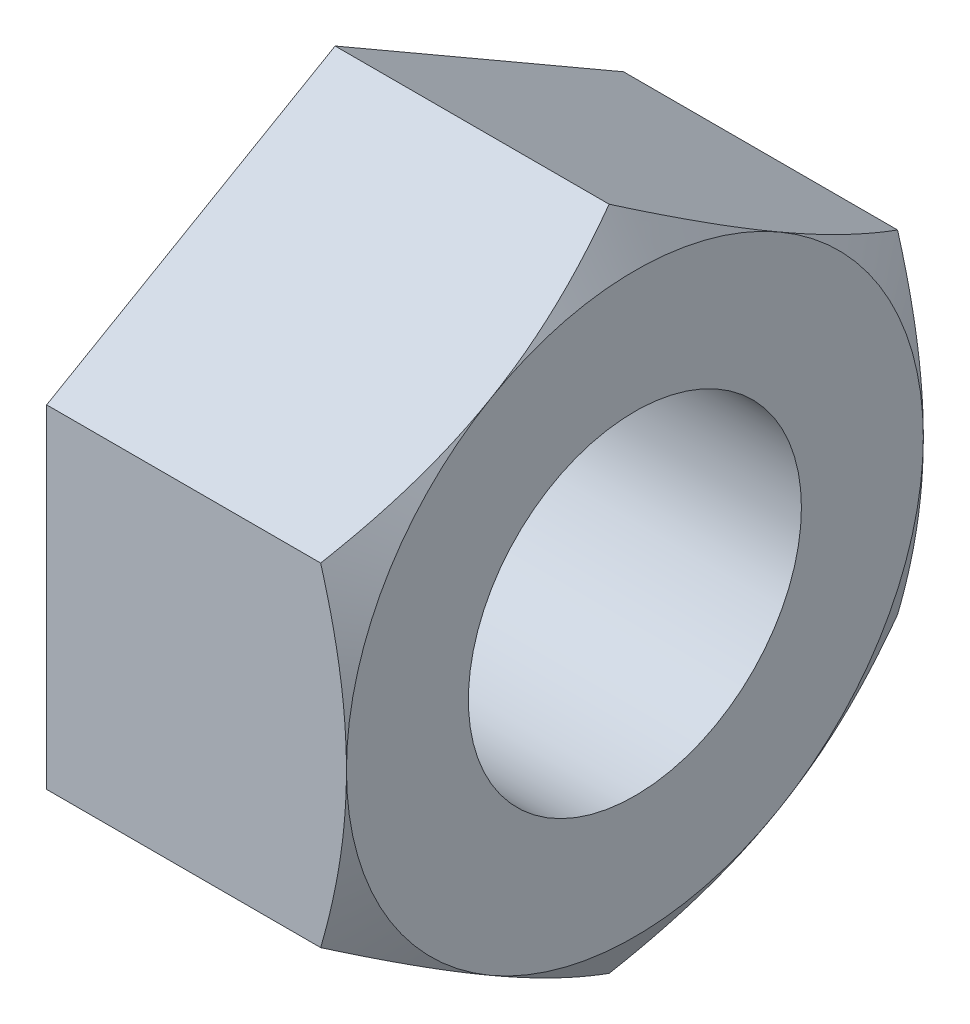
ISO-10303-21;
HEADER;
FILE_DESCRIPTION(('STEP AP214'),'2;1');
FILE_NAME('part.step','',(''),(''),'','','');
FILE_SCHEMA(('AUTOMOTIVE_DESIGN { 1 0 10303 214 1 1 1 1 }'));
ENDSEC;
DATA;
#1=APPLICATION_CONTEXT('core data for automotive mechanical design processes');
#2=APPLICATION_PROTOCOL_DEFINITION('international standard','automotive_design',2000,#1);
#3=PRODUCT_CONTEXT('',#1,'mechanical');
#4=PRODUCT('Part','Part','',(#3));
#5=PRODUCT_RELATED_PRODUCT_CATEGORY('part','',(#4));
#6=PRODUCT_DEFINITION_FORMATION('','',#4);
#7=PRODUCT_DEFINITION_CONTEXT('part definition',#1,'design');
#8=PRODUCT_DEFINITION('design','',#6,#7);
#9=PRODUCT_DEFINITION_SHAPE('','',#8);
#10=(LENGTH_UNIT() NAMED_UNIT(*) SI_UNIT(.MILLI.,.METRE.));
#11=(NAMED_UNIT(*) PLANE_ANGLE_UNIT() SI_UNIT($,.RADIAN.));
#12=(NAMED_UNIT(*) SI_UNIT($,.STERADIAN.) SOLID_ANGLE_UNIT());
#13=UNCERTAINTY_MEASURE_WITH_UNIT(LENGTH_MEASURE(1.E-05),#10,'distance_accuracy_value','');
#14=(GEOMETRIC_REPRESENTATION_CONTEXT(3) GLOBAL_UNCERTAINTY_ASSIGNED_CONTEXT((#13)) GLOBAL_UNIT_ASSIGNED_CONTEXT((#10,
#11,#12)) REPRESENTATION_CONTEXT('',''));
#15=CARTESIAN_POINT('',(0.,0.,0.));
#16=DIRECTION('',(0.,0.,1.));
#17=DIRECTION('',(1.,0.,0.));
#18=AXIS2_PLACEMENT_3D('',#15,#16,#17);
#19=CARTESIAN_POINT('',(-25.2,14.0000000000003,-24.2487113059641));
#20=DIRECTION('',(0.,0.866025403784441,-0.499999999999995));
#21=DIRECTION('',(0.,0.499999999999995,0.866025403784441));
#22=AXIS2_PLACEMENT_3D('',#19,#20,#21);
#23=PLANE('',#22);
#24=DIRECTION('',(1.,0.,0.));
#25=VECTOR('',#24,1.);
#26=CARTESIAN_POINT('',(-25.2,28.,0.));
#27=LINE('',#26,#25);
#28=CARTESIAN_POINT('',(-25.2,28.,0.));
#29=VERTEX_POINT('',#28);
#30=CARTESIAN_POINT('',(-2.16580753730943,28.,0.));
#31=VERTEX_POINT('',#30);
#32=EDGE_CURVE('E142',#29,#31,#27,.T.);
#33=ORIENTED_EDGE('',*,*,#32,.T.);
#34=CARTESIAN_POINT('',(-2.16587420438849,28.0001154700538,0.0002));
#35=CARTESIAN_POINT('',(-1.98822848779229,27.6924015716608,-0.53277610621168));
#36=CARTESIAN_POINT('',(-1.81864411876766,27.383487425241,-1.06783110298759));
#37=CARTESIAN_POINT('',(-1.4978388329674,26.7631820119119,-2.14223159508358));
#38=CARTESIAN_POINT('',(-1.34662395587958,26.4517899659592,-2.68157843974657));
#39=CARTESIAN_POINT('',(-1.06458731292961,25.8259203030604,-3.76561649480328));
#40=CARTESIAN_POINT('',(-0.933814246904632,25.5114371592268,-4.31031727804701));
#41=CARTESIAN_POINT('',(-0.695478379868691,24.8802990244591,-5.40348059405903));
#42=CARTESIAN_POINT('',(-0.587913266688639,24.5636442531268,-5.95194274646575));
#43=CARTESIAN_POINT('',(-0.400559284187938,23.9362568159745,-7.03860966364384));
#44=CARTESIAN_POINT('',(-0.320150834897783,23.6255706866053,-7.57673382491824));
#45=CARTESIAN_POINT('',(-0.185324249523843,23.0027748429148,-8.65544786893295));
#46=CARTESIAN_POINT('',(-0.130906613727792,22.6906651013076,-9.19603779893376));
#47=CARTESIAN_POINT('',(-0.0494356732256569,22.0659213356532,-10.2781257427592));
#48=CARTESIAN_POINT('',(-0.0223498519315814,21.7532883788812,-10.8196219080089));
#49=CARTESIAN_POINT('',(0.00387498579010867,21.1277339645803,-11.9031139364769));
#50=CARTESIAN_POINT('',(0.00301486580607339,20.8148125162653,-12.4451097837365));
#51=CARTESIAN_POINT('',(-0.0247002546745613,20.2298011084469,-13.4583792650854));
#52=CARTESIAN_POINT('',(-0.048175640758247,19.9576694832158,-13.929725066332));
#53=CARTESIAN_POINT('',(-0.11581620222437,19.4140559118843,-14.8712913915622));
#54=CARTESIAN_POINT('',(-0.159981081264717,19.1425739565345,-15.3415119315662));
#55=CARTESIAN_POINT('',(-0.268235206535844,18.6003600291061,-16.2806540024435));
#56=CARTESIAN_POINT('',(-0.332342469721303,18.3296289594629,-16.7495739702531));
#57=CARTESIAN_POINT('',(-0.479346775892425,17.7894631268708,-17.6851686368154));
#58=CARTESIAN_POINT('',(-0.562243739268895,17.5200283584346,-18.1518433450724));
#59=CARTESIAN_POINT('',(-0.841246600012504,16.702081799855,-19.5685683424084));
#60=CARTESIAN_POINT('',(-1.06518734914373,16.1558939383644,-20.5145934689875));
#61=CARTESIAN_POINT('',(-1.44643592846121,15.3426439625243,-21.9231837463969));
#62=CARTESIAN_POINT('',(-1.58093784030191,15.072798974828,-22.3905689752545));
#63=CARTESIAN_POINT('',(-1.86355831732602,14.5349754769091,-23.3221065991545));
#64=CARTESIAN_POINT('',(-2.01167304464737,14.266996463393,-23.7862598659266));
#65=CARTESIAN_POINT('',(-2.16587420438849,13.9998845299464,-24.2489113059641));
#66=B_SPLINE_CURVE_WITH_KNOTS('',3,(#34,#35,#36,#37,#38,#39,#40,#41,#42,#43,#44,#45,#46,#47,#48,
#49,#50,#51,#52,#53,#54,#55,#56,#57,#58,#59,#60,#61,#62,#63,#64,#65),.UNSPECIFIED.,.F.,.F.,(4,2,
2,2,2,2,2,2,2,2,2,2,2,2,2,4),(0.,1.92171215166388,3.84405444089411,5.77090885478267,
7.6975712106906,9.57671951619778,11.455903991291,13.3328501603323,15.2097383278453,
16.8436515929556,18.4775414557296,20.1129117651699,21.7482751459166,25.0910368365272,
26.7595060192956,28.4275062449903),.UNSPECIFIED.);
#67=CARTESIAN_POINT('',(0.,21.0000000000001,-12.1243556529821));
#68=VERTEX_POINT('',#67);
#69=EDGE_CURVE('E73',#31,#68,#66,.T.);
#70=ORIENTED_EDGE('',*,*,#69,.T.);
#71=CARTESIAN_POINT('',(-2.16580753730943,14.0000000000003,-24.2487113059641));
#72=VERTEX_POINT('',#71);
#73=EDGE_CURVE('E120',#68,#72,#66,.T.);
#74=ORIENTED_EDGE('',*,*,#73,.T.);
#75=DIRECTION('',(1.,0.,0.));
#76=VECTOR('',#75,1.);
#77=CARTESIAN_POINT('',(-25.2,14.0000000000003,-24.2487113059641));
#78=LINE('',#77,#76);
#79=CARTESIAN_POINT('',(-25.2,14.0000000000003,-24.2487113059641));
#80=VERTEX_POINT('',#79);
#81=EDGE_CURVE('E238',#80,#72,#78,.T.);
#82=ORIENTED_EDGE('',*,*,#81,.F.);
#83=DIRECTION('',(0.,0.499999999999995,0.866025403784441));
#84=VECTOR('',#83,1.);
#85=CARTESIAN_POINT('',(-25.2,14.0000000000003,-24.2487113059641));
#86=LINE('',#85,#84);
#87=EDGE_CURVE('E283',#80,#29,#86,.T.);
#88=ORIENTED_EDGE('',*,*,#87,.T.);
#89=EDGE_LOOP('',(#33,#70,#74,#82,#88));
#90=FACE_BOUND('',#89,.T.);
#91=ADVANCED_FACE('F48',(#90),#23,.T.);
#92=CARTESIAN_POINT('',(-25.2,-13.9999999999997,-24.2487113059644));
#93=DIRECTION('',(0.,0.,-1.));
#94=DIRECTION('',(0.,1.,0.));
#95=AXIS2_PLACEMENT_3D('',#92,#93,#94);
#96=PLANE('',#95);
#97=ORIENTED_EDGE('',*,*,#81,.T.);
#98=CARTESIAN_POINT('',(-18.2303426068557,50.2830483728458,-24.2487113059637));
#99=CARTESIAN_POINT('',(-17.9264745065844,49.6987243928906,-24.2487113059637));
#100=CARTESIAN_POINT('',(-17.6233883146198,49.1139938821121,-24.2487113059637));
#101=CARTESIAN_POINT('',(-17.0189410529942,47.9436399536802,-24.2487113059637));
#102=CARTESIAN_POINT('',(-16.7175799880843,47.3580165335733,-24.2487113059637));
#103=CARTESIAN_POINT('',(-15.8163038427311,45.5996429904596,-24.2487113059637));
#104=CARTESIAN_POINT('',(-15.219221231962,44.4254384014874,-24.2487113059638));
#105=CARTESIAN_POINT('',(-14.0333205937656,42.070576754026,-24.2487113059638));
#106=CARTESIAN_POINT('',(-13.4445168003427,40.8899125181816,-24.2487113059638));
#107=CARTESIAN_POINT('',(-12.2782639095432,38.5230052069772,-24.2487113059638));
#108=CARTESIAN_POINT('',(-11.7008146406476,37.3367622162246,-24.2487113059638));
#109=CARTESIAN_POINT('',(-10.5282434353,34.8911846059523,-24.2487113059639));
#110=CARTESIAN_POINT('',(-9.93392998935007,33.6314607704398,-24.2487113059639));
#111=CARTESIAN_POINT('',(-9.0575907845175,31.7348465684418,-24.2487113059639));
#112=CARTESIAN_POINT('',(-8.76799178917673,31.1014529147012,-24.2487113059639));
#113=CARTESIAN_POINT('',(-8.1945604785867,29.8320626517861,-24.2487113059639));
#114=CARTESIAN_POINT('',(-7.91072811990552,29.1960660622593,-24.2487113059639));
#115=CARTESIAN_POINT('',(-7.34978996037053,27.9215080616316,-24.2487113059639));
#116=CARTESIAN_POINT('',(-7.07268071188742,27.2829481695521,-24.2487113059639));
#117=CARTESIAN_POINT('',(-6.5260017827102,26.0026141889207,-24.248711305964));
#118=CARTESIAN_POINT('',(-6.25643200564468,25.3608401415768,-24.248711305964));
#119=CARTESIAN_POINT('',(-5.72597845780298,24.0737574547216,-24.248711305964));
#120=CARTESIAN_POINT('',(-5.46509409040655,23.4284490615534,-24.248711305964));
#121=CARTESIAN_POINT('',(-4.95333150562135,22.1338848979091,-24.248711305964));
#122=CARTESIAN_POINT('',(-4.70245308977375,21.4846292060186,-24.248711305964));
#123=CARTESIAN_POINT('',(-4.18176944150496,20.1007218374471,-24.248711305964));
#124=CARTESIAN_POINT('',(-3.91349153859368,19.3654933009253,-24.248711305964));
#125=CARTESIAN_POINT('',(-3.39417392415911,17.8889523571355,-24.248711305964));
#126=CARTESIAN_POINT('',(-3.14313417628384,17.1476399627008,-24.248711305964));
#127=CARTESIAN_POINT('',(-2.6613389512175,15.6582621022633,-24.2487113059641));
#128=CARTESIAN_POINT('',(-2.43058742103364,14.9101953533001,-24.2487113059641));
#129=CARTESIAN_POINT('',(-1.99299902159541,13.407058634502,-24.2487113059641));
#130=CARTESIAN_POINT('',(-1.78616212172445,12.6519886736345,-24.2487113059641));
#131=CARTESIAN_POINT('',(-1.40431392008632,11.1500612990514,-24.2487113059641));
#132=CARTESIAN_POINT('',(-1.22874310419316,10.4033470753554,-24.2487113059641));
#133=CARTESIAN_POINT('',(-0.908434937705082,8.90334868088959,-24.2487113059641));
#134=CARTESIAN_POINT('',(-0.763694877011462,8.15006509364734,-24.2487113059641));
#135=CARTESIAN_POINT('',(-0.50907203472112,6.63792490997426,-24.2487113059642));
#136=CARTESIAN_POINT('',(-0.399173465406968,5.87907099757432,-24.2487113059642));
#137=CARTESIAN_POINT('',(-0.217676121859996,4.35676022946965,-24.2487113059642));
#138=CARTESIAN_POINT('',(-0.146076778216185,3.59330344236851,-24.2487113059642));
#139=CARTESIAN_POINT('',(-0.0429284010364181,2.05117918113006,-24.2487113059642));
#140=CARTESIAN_POINT('',(-0.0120496323283682,1.27246625624166,-24.2487113059642));
#141=CARTESIAN_POINT('',(0.00625168842045326,-0.285473133073758,-24.2487113059642));
#142=CARTESIAN_POINT('',(-0.00632564265255237,-1.06469959611384,-24.2487113059642));
#143=CARTESIAN_POINT('',(-0.074434938256982,-2.62140196320291,-24.2487113059642));
#144=CARTESIAN_POINT('',(-0.129975247427174,-3.398877497747,-24.2487113059643));
#145=CARTESIAN_POINT('',(-0.281879497770434,-4.94980324845539,-24.2487113059643));
#146=CARTESIAN_POINT('',(-0.378244533016532,-5.72325335617881,-24.2487113059643));
#147=CARTESIAN_POINT('',(-0.610870293422916,-7.28084579576749,-24.2487113059643));
#148=CARTESIAN_POINT('',(-0.747933637576008,-8.064867096534,-24.2487113059643));
#149=CARTESIAN_POINT('',(-1.05679861907894,-9.62598349584658,-24.2487113059643));
#150=CARTESIAN_POINT('',(-1.22860083009572,-10.4030784797923,-24.2487113059643));
#151=CARTESIAN_POINT('',(-1.60248434456213,-11.9501637751449,-24.2487113059643));
#152=CARTESIAN_POINT('',(-1.80457561126259,-12.7201516599447,-24.2487113059643));
#153=CARTESIAN_POINT('',(-2.23467433480808,-14.2528090845579,-24.2487113059644));
#154=CARTESIAN_POINT('',(-2.46268186009403,-15.0154786050387,-24.2487113059644));
#155=CARTESIAN_POINT('',(-2.94627154860774,-16.5515093037593,-24.2487113059644));
#156=CARTESIAN_POINT('',(-3.20237172001878,-17.3247065732293,-24.2487113059644));
#157=CARTESIAN_POINT('',(-3.7340114232637,-18.8644161213763,-24.2487113059644));
#158=CARTESIAN_POINT('',(-4.009552261221,-19.6309279469962,-24.2487113059644));
#159=CARTESIAN_POINT('',(-4.57706144021518,-21.1580522611925,-24.2487113059644));
#160=CARTESIAN_POINT('',(-4.86903405215753,-21.9186631570149,-24.2487113059644));
#161=CARTESIAN_POINT('',(-5.46676948195774,-23.4344127896222,-24.2487113059645));
#162=CARTESIAN_POINT('',(-5.77253201213,-24.1895516401839,-24.2487113059645));
#163=CARTESIAN_POINT('',(-6.39614727291469,-25.696001247532,-24.2487113059645));
#164=CARTESIAN_POINT('',(-6.71401573788225,-26.4473054758546,-24.2487113059645));
#165=CARTESIAN_POINT('',(-7.35969325447421,-27.9456257295916,-24.2487113059645));
#166=CARTESIAN_POINT('',(-7.68750234768887,-28.6926417370491,-24.2487113059645));
#167=CARTESIAN_POINT('',(-8.35155360178582,-30.1827805270657,-24.2487113059645));
#168=CARTESIAN_POINT('',(-8.68779453124649,-30.9259038591843,-24.2487113059645));
#169=CARTESIAN_POINT('',(-9.3675547501432,-32.4088069421904,-24.2487113059646));
#170=CARTESIAN_POINT('',(-9.71107402377708,-33.1485867003329,-24.2487113059646));
#171=CARTESIAN_POINT('',(-10.7078671570518,-35.2716200488844,-24.2487113059646));
#172=CARTESIAN_POINT('',(-11.3690161082574,-36.6511769873956,-24.2487113059646));
#173=CARTESIAN_POINT('',(-12.7081825478356,-39.4021191908811,-24.2487113059646));
#174=CARTESIAN_POINT('',(-13.3862007276722,-40.773504118022,-24.2487113059646));
#175=CARTESIAN_POINT('',(-14.4117907962584,-42.8229432728247,-24.2487113059647));
#176=CARTESIAN_POINT('',(-14.7544000715297,-43.5034874989141,-24.2487113059647));
#177=CARTESIAN_POINT('',(-15.4425446508473,-44.8630962590798,-24.2487113059647));
#178=CARTESIAN_POINT('',(-15.7880799578433,-45.5421607916636,-24.2487113059647));
#179=CARTESIAN_POINT('',(-16.4817253032553,-46.8988922038909,-24.2487113059647));
#180=CARTESIAN_POINT('',(-16.8298350965783,-47.5765592089208,-24.2487113059647));
#181=CARTESIAN_POINT('',(-17.5283972322836,-48.9306810248819,-24.2487113059647));
#182=CARTESIAN_POINT('',(-17.8788495639677,-49.6071358413312,-24.2487113059647));
#183=CARTESIAN_POINT('',(-18.2303426068557,-50.2830483728453,-24.2487113059647));
#184=B_SPLINE_CURVE_WITH_KNOTS('',3,(#98,#99,#100,#101,#102,#103,#104,#105,#106,#107,#108,#109,
#110,#111,#112,#113,#114,#115,#116,#117,#118,#119,#120,#121,#122,#123,#124,#125,#126,#127,#128,
#129,#130,#131,#132,#133,#134,#135,#136,#137,#138,#139,#140,#141,#142,#143,#144,#145,#146,#147,
#148,#149,#150,#151,#152,#153,#154,#155,#156,#157,#158,#159,#160,#161,#162,#163,#164,#165,#166,
#167,#168,#169,#170,#171,#172,#173,#174,#175,#176,#177,#178,#179,#180,#181,#182,#183),
.UNSPECIFIED.,.F.,.F.,(4,2,2,2,2,2,2,2,2,2,2,2,2,2,2,2,2,2,2,2,2,2,2,2,2,2,2,2,2,2,2,2,2,2,2,2,
2,2,2,2,2,2,4),(0.,1.9758362561437,3.95167795130731,7.90352645534567,11.8614961868176,
15.8194060840877,19.9978841393504,22.0872380625785,24.1765762438179,26.264819336735,
28.353035724993,30.4411083717679,32.529139582931,34.8768926695487,37.2246408050505,
39.5728446813608,41.9210455513619,44.2217091905884,46.5221705123278,48.8215879316788,
51.120971163656,53.4577487046618,55.7945199603156,58.1317451977576,60.4690330751024,
62.8558806368755,65.242767617533,67.6304414685264,70.0181216251518,72.4613364738751,
74.9047156268658,77.3487328165168,79.7926990425867,82.2399580793445,84.6872273565239,
87.1341412818893,89.5810498952545,94.1702893922292,98.7597173115204,101.045470476437,
103.33122594587,105.61676654125,107.902296705683),.UNSPECIFIED.);
#185=CARTESIAN_POINT('',(0.,2.49384223390369E-13,-24.2487113059644));
#186=VERTEX_POINT('',#185);
#187=EDGE_CURVE('E123',#72,#186,#184,.T.);
#188=ORIENTED_EDGE('',*,*,#187,.T.);
#189=CARTESIAN_POINT('',(-2.16580753730943,-13.9999999999997,-24.2487113059644));
#190=VERTEX_POINT('',#189);
#191=EDGE_CURVE('E156',#186,#190,#184,.T.);
#192=ORIENTED_EDGE('',*,*,#191,.T.);
#193=DIRECTION('',(1.,0.,0.));
#194=VECTOR('',#193,1.);
#195=CARTESIAN_POINT('',(-25.2,-13.9999999999997,-24.2487113059644));
#196=LINE('',#195,#194);
#197=CARTESIAN_POINT('',(-25.2,-13.9999999999997,-24.2487113059644));
#198=VERTEX_POINT('',#197);
#199=EDGE_CURVE('E244',#198,#190,#196,.T.);
#200=ORIENTED_EDGE('',*,*,#199,.F.);
#201=DIRECTION('',(0.,1.,0.));
#202=VECTOR('',#201,1.);
#203=CARTESIAN_POINT('',(-25.2,-13.9999999999997,-24.2487113059644));
#204=LINE('',#203,#202);
#205=EDGE_CURVE('E241',#198,#80,#204,.T.);
#206=ORIENTED_EDGE('',*,*,#205,.T.);
#207=EDGE_LOOP('',(#97,#188,#192,#200,#206));
#208=FACE_BOUND('',#207,.T.);
#209=ADVANCED_FACE('F209',(#208),#96,.T.);
#210=CARTESIAN_POINT('',(-25.2,-28.,-1.95522954975215E-13));
#211=DIRECTION('',(0.,-0.866025403784435,-0.500000000000007));
#212=DIRECTION('',(0.,0.500000000000007,-0.866025403784435));
#213=AXIS2_PLACEMENT_3D('',#210,#211,#212);
#214=PLANE('',#213);
#215=ORIENTED_EDGE('',*,*,#199,.T.);
#216=CARTESIAN_POINT('',(-2.16587420438849,-13.9998845299459,-24.2489113059644));
#217=CARTESIAN_POINT('',(-1.98822848779229,-14.3075984283389,-23.7159351997527));
#218=CARTESIAN_POINT('',(-1.81864411876765,-14.6165125747587,-23.1808802029768));
#219=CARTESIAN_POINT('',(-1.49783883296739,-15.2368179880878,-22.1064797108808));
#220=CARTESIAN_POINT('',(-1.34662395587956,-15.5482100340405,-21.5671328662178));
#221=CARTESIAN_POINT('',(-1.06458731292959,-16.1740796969393,-20.4830948111611));
#222=CARTESIAN_POINT('',(-0.933814246904612,-16.4885628407729,-19.9383940279174));
#223=CARTESIAN_POINT('',(-0.695478379868666,-17.1197009755407,-18.8452307119054));
#224=CARTESIAN_POINT('',(-0.58791326668861,-17.436355746873,-18.2967685594987));
#225=CARTESIAN_POINT('',(-0.400559284187903,-18.0637431840253,-17.2101016423206));
#226=CARTESIAN_POINT('',(-0.320150834897745,-18.3744293133945,-16.6719774810462));
#227=CARTESIAN_POINT('',(-0.1853242495238,-18.997225157085,-15.5932634370315));
#228=CARTESIAN_POINT('',(-0.130906613727748,-19.3093348986922,-15.0526735070307));
#229=CARTESIAN_POINT('',(-0.0494356732256077,-19.9340786643467,-13.9705855632053));
#230=CARTESIAN_POINT('',(-0.0223498519315288,-20.2467116211187,-13.4290893979556));
#231=CARTESIAN_POINT('',(0.00387498579016621,-20.8722660354196,-12.3455973694875));
#232=CARTESIAN_POINT('',(0.00301486580613238,-21.1851874837346,-11.8036015222279));
#233=CARTESIAN_POINT('',(-0.0247002546744988,-21.770198891553,-10.7903320408791));
#234=CARTESIAN_POINT('',(-0.0481756407581831,-22.0423305167841,-10.3189862396324));
#235=CARTESIAN_POINT('',(-0.115816202224305,-22.5859440881156,-9.37741991440227));
#236=CARTESIAN_POINT('',(-0.159981081264652,-22.8574260434655,-8.90719937439824));
#237=CARTESIAN_POINT('',(-0.26823520653578,-23.3996399708938,-7.96805730352087));
#238=CARTESIAN_POINT('',(-0.33234246972124,-23.6703710405371,-7.4991373357113));
#239=CARTESIAN_POINT('',(-0.479346775892364,-24.2105368731292,-6.563542669149));
#240=CARTESIAN_POINT('',(-0.562243739268836,-24.4799716415654,-6.09686796089199));
#241=CARTESIAN_POINT('',(-0.841246600012452,-25.297918200145,-4.68014296355597));
#242=CARTESIAN_POINT('',(-1.06518734914368,-25.8441060616356,-3.73411783697685));
#243=CARTESIAN_POINT('',(-1.44643592846118,-26.6573560374759,-2.32552755956746));
#244=CARTESIAN_POINT('',(-1.58093784030189,-26.9272010251721,-1.85814233070979));
#245=CARTESIAN_POINT('',(-1.86355831732601,-27.465024523091,-0.926604706809807));
#246=CARTESIAN_POINT('',(-2.01167304464736,-27.7330035366072,-0.4624514400377));
#247=CARTESIAN_POINT('',(-2.16587420438849,-28.0001154700538,0.000199999999803655));
#248=B_SPLINE_CURVE_WITH_KNOTS('',3,(#216,#217,#218,#219,#220,#221,#222,#223,#224,#225,#226,
#227,#228,#229,#230,#231,#232,#233,#234,#235,#236,#237,#238,#239,#240,#241,#242,#243,#244,#245,
#246,#247),.UNSPECIFIED.,.F.,.F.,(4,2,2,2,2,2,2,2,2,2,2,2,2,2,2,4),(0.,1.92171215166388,
3.84405444089411,5.77090885478267,7.69757121069059,9.57671951619778,11.455903991291,
13.3328501603323,15.2097383278453,16.8436515929556,18.4775414557297,20.1129117651701,
21.7482751459167,25.0910368365275,26.7595060192959,28.4275062449906),.UNSPECIFIED.);
#249=CARTESIAN_POINT('',(0.,-21.,-12.1243556529824));
#250=VERTEX_POINT('',#249);
#251=EDGE_CURVE('E203',#190,#250,#248,.T.);
#252=ORIENTED_EDGE('',*,*,#251,.T.);
#253=CARTESIAN_POINT('',(-2.16580753730943,-28.,-1.95498945679743E-13));
#254=VERTEX_POINT('',#253);
#255=EDGE_CURVE('E195',#250,#254,#248,.T.);
#256=ORIENTED_EDGE('',*,*,#255,.T.);
#257=DIRECTION('',(1.,0.,0.));
#258=VECTOR('',#257,1.);
#259=CARTESIAN_POINT('',(-25.2,-28.,-1.95522954975215E-13));
#260=LINE('',#259,#258);
#261=CARTESIAN_POINT('',(-25.2,-28.,-1.95522954975215E-13));
#262=VERTEX_POINT('',#261);
#263=EDGE_CURVE('E250',#262,#254,#260,.T.);
#264=ORIENTED_EDGE('',*,*,#263,.F.);
#265=DIRECTION('',(0.,0.500000000000007,-0.866025403784434));
#266=VECTOR('',#265,1.);
#267=CARTESIAN_POINT('',(-25.2,-28.,-1.95522954975215E-13));
#268=LINE('',#267,#266);
#269=EDGE_CURVE('E266',#262,#198,#268,.T.);
#270=ORIENTED_EDGE('',*,*,#269,.T.);
#271=EDGE_LOOP('',(#215,#252,#256,#264,#270));
#272=FACE_BOUND('',#271,.T.);
#273=ADVANCED_FACE('F205',(#272),#214,.T.);
#274=CARTESIAN_POINT('',(-25.2,-14.0000000000001,24.2487113059642));
#275=DIRECTION('',(0.,-0.866025403784442,0.499999999999995));
#276=DIRECTION('',(0.,-0.499999999999995,-0.866025403784442));
#277=AXIS2_PLACEMENT_3D('',#274,#275,#276);
#278=PLANE('',#277);
#279=ORIENTED_EDGE('',*,*,#263,.T.);
#280=CARTESIAN_POINT('',(-2.16587420438849,-28.0001154700538,-0.000200000000195523));
#281=CARTESIAN_POINT('',(-1.98822848779229,-27.6924015716608,0.532776106211481));
#282=CARTESIAN_POINT('',(-1.81864411876766,-27.383487425241,1.06783110298739));
#283=CARTESIAN_POINT('',(-1.49783883296739,-26.7631820119119,2.14223159508338));
#284=CARTESIAN_POINT('',(-1.34662395587956,-26.4517899659592,2.68157843974637));
#285=CARTESIAN_POINT('',(-1.06458731292959,-25.8259203030604,3.76561649480308));
#286=CARTESIAN_POINT('',(-0.933814246904612,-25.5114371592268,4.31031727804681));
#287=CARTESIAN_POINT('',(-0.695478379868667,-24.8802990244591,5.40348059405883));
#288=CARTESIAN_POINT('',(-0.587913266688613,-24.5636442531268,5.95194274646554));
#289=CARTESIAN_POINT('',(-0.400559284187906,-23.9362568159745,7.03860966364364));
#290=CARTESIAN_POINT('',(-0.320150834897748,-23.6255706866053,7.57673382491804));
#291=CARTESIAN_POINT('',(-0.185324249523802,-23.0027748429148,8.65544786893275));
#292=CARTESIAN_POINT('',(-0.130906613727748,-22.6906651013076,9.19603779893355));
#293=CARTESIAN_POINT('',(-0.049435673225608,-22.0659213356532,10.278125742759));
#294=CARTESIAN_POINT('',(-0.0223498519315293,-21.7532883788812,10.8196219080087));
#295=CARTESIAN_POINT('',(0.00387498579016576,-21.1277339645803,11.9031139364767));
#296=CARTESIAN_POINT('',(0.00301486580613216,-20.8148125162653,12.4451097837363));
#297=CARTESIAN_POINT('',(-0.0247002546744985,-20.2298011084469,13.4583792650852));
#298=CARTESIAN_POINT('',(-0.0481756407581826,-19.9576694832158,13.9297250663318));
#299=CARTESIAN_POINT('',(-0.115816202224304,-19.4140559118843,14.871291391562));
#300=CARTESIAN_POINT('',(-0.15998108126465,-19.1425739565344,15.3415119315661));
#301=CARTESIAN_POINT('',(-0.268235206535779,-18.6003600291061,16.2806540024434));
#302=CARTESIAN_POINT('',(-0.33234246972124,-18.3296289594628,16.749573970253));
#303=CARTESIAN_POINT('',(-0.479346775892367,-17.7894631268707,17.6851686368153));
#304=CARTESIAN_POINT('',(-0.562243739268839,-17.5200283584345,18.1518433450723));
#305=CARTESIAN_POINT('',(-0.841246600012456,-16.7020817998549,19.5685683424084));
#306=CARTESIAN_POINT('',(-1.06518734914369,-16.1558939383643,20.5145934689875));
#307=CARTESIAN_POINT('',(-1.44643592846119,-15.3426439625241,21.9231837463969));
#308=CARTESIAN_POINT('',(-1.58093784030189,-15.0727989748279,22.3905689752546));
#309=CARTESIAN_POINT('',(-1.86355831732601,-14.534975476909,23.3221065991546));
#310=CARTESIAN_POINT('',(-2.01167304464736,-14.2669964633929,23.7862598659267));
#311=CARTESIAN_POINT('',(-2.16587420438849,-13.9998845299462,24.2489113059642));
#312=B_SPLINE_CURVE_WITH_KNOTS('',3,(#280,#281,#282,#283,#284,#285,#286,#287,#288,#289,#290,
#291,#292,#293,#294,#295,#296,#297,#298,#299,#300,#301,#302,#303,#304,#305,#306,#307,#308,#309,
#310,#311),.UNSPECIFIED.,.F.,.F.,(4,2,2,2,2,2,2,2,2,2,2,2,2,2,2,4),(0.,1.92171215166389,
3.84405444089411,5.77090885478267,7.69757121069059,9.57671951619779,11.455903991291,
13.3328501603323,15.2097383278453,16.8436515929556,18.4775414557297,20.1129117651701,
21.7482751459167,25.0910368365275,26.7595060192959,28.4275062449906),.UNSPECIFIED.);
#313=CARTESIAN_POINT('',(0.,-21.0000000000001,12.1243556529821));
#314=VERTEX_POINT('',#313);
#315=EDGE_CURVE('E204',#254,#314,#312,.T.);
#316=ORIENTED_EDGE('',*,*,#315,.T.);
#317=CARTESIAN_POINT('',(-2.16580753730943,-14.0000000000001,24.2487113059642));
#318=VERTEX_POINT('',#317);
#319=EDGE_CURVE('E189',#314,#318,#312,.T.);
#320=ORIENTED_EDGE('',*,*,#319,.T.);
#321=DIRECTION('',(1.,0.,0.));
#322=VECTOR('',#321,1.);
#323=CARTESIAN_POINT('',(-25.2,-14.0000000000001,24.2487113059642));
#324=LINE('',#323,#322);
#325=CARTESIAN_POINT('',(-25.2,-14.0000000000001,24.2487113059642));
#326=VERTEX_POINT('',#325);
#327=EDGE_CURVE('E258',#326,#318,#324,.T.);
#328=ORIENTED_EDGE('',*,*,#327,.F.);
#329=DIRECTION('',(0.,-0.499999999999995,-0.866025403784442));
#330=VECTOR('',#329,1.);
#331=CARTESIAN_POINT('',(-25.2,-14.0000000000001,24.2487113059642));
#332=LINE('',#331,#330);
#333=EDGE_CURVE('E269',#326,#262,#332,.T.);
#334=ORIENTED_EDGE('',*,*,#333,.T.);
#335=EDGE_LOOP('',(#279,#316,#320,#328,#334));
#336=FACE_BOUND('',#335,.T.);
#337=ADVANCED_FACE('F208',(#336),#278,.T.);
#338=CARTESIAN_POINT('',(-25.2,13.9999999999999,24.2487113059643));
#339=DIRECTION('',(0.,0.,1.));
#340=DIRECTION('',(0.,-1.,0.));
#341=AXIS2_PLACEMENT_3D('',#338,#339,#340);
#342=PLANE('',#341);
#343=ORIENTED_EDGE('',*,*,#327,.T.);
#344=CARTESIAN_POINT('',(-18.2303426068557,-50.2830483728456,24.2487113059641));
#345=CARTESIAN_POINT('',(-17.9264745065844,-49.6987243928904,24.2487113059641));
#346=CARTESIAN_POINT('',(-17.6233883146198,-49.1139938821119,24.2487113059641));
#347=CARTESIAN_POINT('',(-17.0189410529942,-47.9436399536801,24.2487113059641));
#348=CARTESIAN_POINT('',(-16.7175799880843,-47.3580165335732,24.2487113059641));
#349=CARTESIAN_POINT('',(-15.8163038427311,-45.5996429904594,24.2487113059641));
#350=CARTESIAN_POINT('',(-15.219221231962,-44.4254384014872,24.2487113059641));
#351=CARTESIAN_POINT('',(-14.0333205937656,-42.0705767540258,24.2487113059641));
#352=CARTESIAN_POINT('',(-13.4445168003427,-40.8899125181814,24.2487113059641));
#353=CARTESIAN_POINT('',(-12.2782639095432,-38.523005206977,24.2487113059641));
#354=CARTESIAN_POINT('',(-11.7008146406476,-37.3367622162244,24.2487113059641));
#355=CARTESIAN_POINT('',(-10.5282434353,-34.8911846059521,24.2487113059641));
#356=CARTESIAN_POINT('',(-9.93392998935007,-33.6314607704396,24.2487113059641));
#357=CARTESIAN_POINT('',(-9.0575907845175,-31.7348465684416,24.2487113059641));
#358=CARTESIAN_POINT('',(-8.76799178917673,-31.101452914701,24.2487113059641));
#359=CARTESIAN_POINT('',(-8.1945604785867,-29.832062651786,24.2487113059641));
#360=CARTESIAN_POINT('',(-7.91072811990552,-29.1960660622592,24.2487113059641));
#361=CARTESIAN_POINT('',(-7.34978996037053,-27.9215080616314,24.2487113059641));
#362=CARTESIAN_POINT('',(-7.07268071188742,-27.2829481695519,24.2487113059641));
#363=CARTESIAN_POINT('',(-6.5260017827102,-26.0026141889205,24.2487113059641));
#364=CARTESIAN_POINT('',(-6.25643200564468,-25.3608401415766,24.2487113059641));
#365=CARTESIAN_POINT('',(-5.72597845780298,-24.0737574547215,24.2487113059641));
#366=CARTESIAN_POINT('',(-5.46509409040655,-23.4284490615532,24.2487113059642));
#367=CARTESIAN_POINT('',(-4.95333150562135,-22.1338848979089,24.2487113059642));
#368=CARTESIAN_POINT('',(-4.70245308977375,-21.4846292060185,24.2487113059642));
#369=CARTESIAN_POINT('',(-4.18176944150496,-20.100721837447,24.2487113059642));
#370=CARTESIAN_POINT('',(-3.91349153859368,-19.3654933009252,24.2487113059642));
#371=CARTESIAN_POINT('',(-3.39417392415911,-17.8889523571353,24.2487113059642));
#372=CARTESIAN_POINT('',(-3.14313417628384,-17.1476399627006,24.2487113059642));
#373=CARTESIAN_POINT('',(-2.6613389512175,-15.6582621022632,24.2487113059642));
#374=CARTESIAN_POINT('',(-2.43058742103364,-14.9101953532999,24.2487113059642));
#375=CARTESIAN_POINT('',(-1.99299902159541,-13.4070586345019,24.2487113059642));
#376=CARTESIAN_POINT('',(-1.78616212172445,-12.6519886736343,24.2487113059642));
#377=CARTESIAN_POINT('',(-1.40431392008632,-11.1500612990513,24.2487113059642));
#378=CARTESIAN_POINT('',(-1.22874310419316,-10.4033470753552,24.2487113059642));
#379=CARTESIAN_POINT('',(-0.90843493770508,-8.90334868088941,24.2487113059642));
#380=CARTESIAN_POINT('',(-0.763694877011461,-8.15006509364715,24.2487113059642));
#381=CARTESIAN_POINT('',(-0.50907203472112,-6.63792490997408,24.2487113059642));
#382=CARTESIAN_POINT('',(-0.399173465406968,-5.87907099757413,24.2487113059642));
#383=CARTESIAN_POINT('',(-0.217676121859997,-4.35676022946947,24.2487113059642));
#384=CARTESIAN_POINT('',(-0.146076778216187,-3.59330344236832,24.2487113059642));
#385=CARTESIAN_POINT('',(-0.0429284010364215,-2.05117918112987,24.2487113059642));
#386=CARTESIAN_POINT('',(-0.0120496323283709,-1.27246625624147,24.2487113059642));
#387=CARTESIAN_POINT('',(0.00625168842045208,0.28547313307394,24.2487113059642));
#388=CARTESIAN_POINT('',(-0.00632564265255264,1.06469959611402,24.2487113059642));
#389=CARTESIAN_POINT('',(-0.074434938256983,2.62140196320309,24.2487113059642));
#390=CARTESIAN_POINT('',(-0.129975247427177,3.39887749774718,24.2487113059642));
#391=CARTESIAN_POINT('',(-0.281879497770438,4.94980324845558,24.2487113059642));
#392=CARTESIAN_POINT('',(-0.378244533016536,5.723253356179,24.2487113059642));
#393=CARTESIAN_POINT('',(-0.610870293422921,7.28084579576768,24.2487113059642));
#394=CARTESIAN_POINT('',(-0.747933637576013,8.06486709653419,24.2487113059642));
#395=CARTESIAN_POINT('',(-1.05679861907895,9.62598349584677,24.2487113059643));
#396=CARTESIAN_POINT('',(-1.22860083009572,10.4030784797925,24.2487113059643));
#397=CARTESIAN_POINT('',(-1.60248434456214,11.950163775145,24.2487113059643));
#398=CARTESIAN_POINT('',(-1.80457561126259,12.7201516599449,24.2487113059643));
#399=CARTESIAN_POINT('',(-2.23467433480809,14.252809084558,24.2487113059643));
#400=CARTESIAN_POINT('',(-2.46268186009404,15.0154786050389,24.2487113059643));
#401=CARTESIAN_POINT('',(-2.94627154860774,16.5515093037595,24.2487113059643));
#402=CARTESIAN_POINT('',(-3.20237172001879,17.3247065732295,24.2487113059643));
#403=CARTESIAN_POINT('',(-3.73401142326371,18.8644161213764,24.2487113059643));
#404=CARTESIAN_POINT('',(-4.00955226122101,19.6309279469964,24.2487113059643));
#405=CARTESIAN_POINT('',(-4.57706144021519,21.1580522611927,24.2487113059643));
#406=CARTESIAN_POINT('',(-4.86903405215754,21.9186631570151,24.2487113059643));
#407=CARTESIAN_POINT('',(-5.46676948195775,23.4344127896224,24.2487113059643));
#408=CARTESIAN_POINT('',(-5.77253201213,24.1895516401841,24.2487113059643));
#409=CARTESIAN_POINT('',(-6.3961472729147,25.6960012475322,24.2487113059643));
#410=CARTESIAN_POINT('',(-6.71401573788226,26.4473054758548,24.2487113059643));
#411=CARTESIAN_POINT('',(-7.35969325447422,27.9456257295918,24.2487113059643));
#412=CARTESIAN_POINT('',(-7.68750234768888,28.6926417370492,24.2487113059643));
#413=CARTESIAN_POINT('',(-8.35155360178583,30.1827805270659,24.2487113059643));
#414=CARTESIAN_POINT('',(-8.6877945312465,30.9259038591845,24.2487113059643));
#415=CARTESIAN_POINT('',(-9.36755475014321,32.4088069421906,24.2487113059643));
#416=CARTESIAN_POINT('',(-9.71107402377709,33.1485867003331,24.2487113059643));
#417=CARTESIAN_POINT('',(-10.7078671570518,35.2716200488845,24.2487113059643));
#418=CARTESIAN_POINT('',(-11.3690161082574,36.6511769873958,24.2487113059643));
#419=CARTESIAN_POINT('',(-12.7081825478356,39.4021191908813,24.2487113059644));
#420=CARTESIAN_POINT('',(-13.3862007276722,40.7735041180222,24.2487113059644));
#421=CARTESIAN_POINT('',(-14.4117907962584,42.8229432728248,24.2487113059644));
#422=CARTESIAN_POINT('',(-14.7544000715297,43.5034874989143,24.2487113059644));
#423=CARTESIAN_POINT('',(-15.4425446508473,44.86309625908,24.2487113059644));
#424=CARTESIAN_POINT('',(-15.7880799578433,45.5421607916637,24.2487113059644));
#425=CARTESIAN_POINT('',(-16.4817253032553,46.898892203891,24.2487113059644));
#426=CARTESIAN_POINT('',(-16.8298350965783,47.576559208921,24.2487113059644));
#427=CARTESIAN_POINT('',(-17.5283972322837,48.930681024882,24.2487113059644));
#428=CARTESIAN_POINT('',(-17.8788495639677,49.6071358413313,24.2487113059644));
#429=CARTESIAN_POINT('',(-18.2303426068557,50.2830483728454,24.2487113059644));
#430=B_SPLINE_CURVE_WITH_KNOTS('',3,(#344,#345,#346,#347,#348,#349,#350,#351,#352,#353,#354,
#355,#356,#357,#358,#359,#360,#361,#362,#363,#364,#365,#366,#367,#368,#369,#370,#371,#372,#373,
#374,#375,#376,#377,#378,#379,#380,#381,#382,#383,#384,#385,#386,#387,#388,#389,#390,#391,#392,
#393,#394,#395,#396,#397,#398,#399,#400,#401,#402,#403,#404,#405,#406,#407,#408,#409,#410,#411,
#412,#413,#414,#415,#416,#417,#418,#419,#420,#421,#422,#423,#424,#425,#426,#427,#428,#429),
.UNSPECIFIED.,.F.,.F.,(4,2,2,2,2,2,2,2,2,2,2,2,2,2,2,2,2,2,2,2,2,2,2,2,2,2,2,2,2,2,2,2,2,2,2,2,
2,2,2,2,2,2,4),(0.,1.97583625614371,3.95167795130731,7.90352645534568,11.8614961868176,
15.8194060840877,19.9978841393504,22.0872380625785,24.1765762438179,26.264819336735,
28.353035724993,30.4411083717679,32.529139582931,34.8768926695487,37.2246408050505,
39.5728446813608,41.9210455513619,44.2217091905884,46.5221705123278,48.8215879316788,
51.120971163656,53.4577487046618,55.7945199603156,58.1317451977576,60.4690330751024,
62.8558806368755,65.2427676175331,67.6304414685264,70.0181216251518,72.4613364738751,
74.9047156268658,77.3487328165168,79.7926990425867,82.2399580793445,84.6872273565239,
87.1341412818894,89.5810498952545,94.1702893922292,98.7597173115204,101.045470476437,
103.33122594587,105.61676654125,107.902296705683),.UNSPECIFIED.);
#431=CARTESIAN_POINT('',(0.,0.,24.2487113059644));
#432=VERTEX_POINT('',#431);
#433=EDGE_CURVE('E457',#318,#432,#430,.T.);
#434=ORIENTED_EDGE('',*,*,#433,.T.);
#435=CARTESIAN_POINT('',(-2.16580753730943,13.9999999999999,24.2487113059643));
#436=VERTEX_POINT('',#435);
#437=EDGE_CURVE('E182',#432,#436,#430,.T.);
#438=ORIENTED_EDGE('',*,*,#437,.T.);
#439=DIRECTION('',(1.,0.,0.));
#440=VECTOR('',#439,1.);
#441=CARTESIAN_POINT('',(-25.2,13.9999999999999,24.2487113059643));
#442=LINE('',#441,#440);
#443=CARTESIAN_POINT('',(-25.2,13.9999999999999,24.2487113059643));
#444=VERTEX_POINT('',#443);
#445=EDGE_CURVE('E262',#444,#436,#442,.T.);
#446=ORIENTED_EDGE('',*,*,#445,.F.);
#447=DIRECTION('',(0.,-1.,0.));
#448=VECTOR('',#447,1.);
#449=CARTESIAN_POINT('',(-25.2,13.9999999999999,24.2487113059643));
#450=LINE('',#449,#448);
#451=EDGE_CURVE('E273',#444,#326,#450,.T.);
#452=ORIENTED_EDGE('',*,*,#451,.T.);
#453=EDGE_LOOP('',(#343,#434,#438,#446,#452));
#454=FACE_BOUND('',#453,.T.);
#455=ADVANCED_FACE('F215',(#454),#342,.T.);
#456=CARTESIAN_POINT('',(-25.2,28.,0.));
#457=DIRECTION('',(0.,0.866025403784438,0.500000000000001));
#458=DIRECTION('',(0.,-0.500000000000001,0.866025403784438));
#459=AXIS2_PLACEMENT_3D('',#456,#457,#458);
#460=PLANE('',#459);
#461=ORIENTED_EDGE('',*,*,#445,.T.);
#462=CARTESIAN_POINT('',(-2.16587420438849,13.9998845299461,24.2489113059643));
#463=CARTESIAN_POINT('',(-1.98822848779229,14.307598428339,23.7159351997526));
#464=CARTESIAN_POINT('',(-1.81864411876766,14.6165125747589,23.1808802029767));
#465=CARTESIAN_POINT('',(-1.49783883296739,15.2368179880879,22.1064797108807));
#466=CARTESIAN_POINT('',(-1.34662395587956,15.5482100340407,21.5671328662177));
#467=CARTESIAN_POINT('',(-1.06458731292959,16.1740796969395,20.483094811161));
#468=CARTESIAN_POINT('',(-0.933814246904613,16.4885628407731,19.9383940279173));
#469=CARTESIAN_POINT('',(-0.695478379868668,17.1197009755408,18.8452307119053));
#470=CARTESIAN_POINT('',(-0.587913266688613,17.4363557468732,18.2967685594986));
#471=CARTESIAN_POINT('',(-0.400559284187905,18.0637431840254,17.2101016423205));
#472=CARTESIAN_POINT('',(-0.320150834897746,18.3744293133946,16.6719774810461));
#473=CARTESIAN_POINT('',(-0.185324249523801,18.9972251570851,15.5932634370314));
#474=CARTESIAN_POINT('',(-0.13090661372775,19.3093348986923,15.0526735070306));
#475=CARTESIAN_POINT('',(-0.0494356732256106,19.9340786643467,13.9705855632051));
#476=CARTESIAN_POINT('',(-0.022349851931531,20.2467116211188,13.4290893979555));
#477=CARTESIAN_POINT('',(0.00387498579016549,20.8722660354196,12.3455973694874));
#478=CARTESIAN_POINT('',(0.00301486580613264,21.1851874837346,11.8036015222278));
#479=CARTESIAN_POINT('',(-0.0247002546744989,21.770198891553,10.7903320408789));
#480=CARTESIAN_POINT('',(-0.0481756407581843,22.0423305167842,10.3189862396323));
#481=CARTESIAN_POINT('',(-0.115816202224306,22.5859440881157,9.37741991440212));
#482=CARTESIAN_POINT('',(-0.159981081264651,22.8574260434655,8.90719937439808));
#483=CARTESIAN_POINT('',(-0.26823520653578,23.3996399708939,7.96805730352071));
#484=CARTESIAN_POINT('',(-0.332342469721242,23.6703710405371,7.49913733571114));
#485=CARTESIAN_POINT('',(-0.479346775892369,24.2105368731293,6.56354266914883));
#486=CARTESIAN_POINT('',(-0.56224373926884,24.4799716415654,6.09686796089182));
#487=CARTESIAN_POINT('',(-0.841246600012455,25.2979182001451,4.68014296355579));
#488=CARTESIAN_POINT('',(-1.06518734914369,25.8441060616357,3.73411783697667));
#489=CARTESIAN_POINT('',(-1.44643592846119,26.6573560374759,2.32552755956727));
#490=CARTESIAN_POINT('',(-1.58093784030189,26.9272010251721,1.8581423307096));
#491=CARTESIAN_POINT('',(-1.86355831732601,27.465024523091,0.926604706809614));
#492=CARTESIAN_POINT('',(-2.01167304464736,27.7330035366072,0.462451440037506));
#493=CARTESIAN_POINT('',(-2.16587420438849,28.0001154700538,-0.000199999999999627));
#494=B_SPLINE_CURVE_WITH_KNOTS('',3,(#462,#463,#464,#465,#466,#467,#468,#469,#470,#471,#472,
#473,#474,#475,#476,#477,#478,#479,#480,#481,#482,#483,#484,#485,#486,#487,#488,#489,#490,#491,
#492,#493),.UNSPECIFIED.,.F.,.F.,(4,2,2,2,2,2,2,2,2,2,2,2,2,2,2,4),(0.,1.92171215166388,
3.84405444089411,5.77090885478267,7.6975712106906,9.57671951619779,11.455903991291,
13.3328501603323,15.2097383278453,16.8436515929556,18.4775414557297,20.1129117651701,
21.7482751459167,25.0910368365275,26.7595060192959,28.4275062449906),.UNSPECIFIED.);
#495=CARTESIAN_POINT('',(0.,21.0000000000001,12.1243556529822));
#496=VERTEX_POINT('',#495);
#497=EDGE_CURVE('E467',#436,#496,#494,.T.);
#498=ORIENTED_EDGE('',*,*,#497,.T.);
#499=EDGE_CURVE('E129',#496,#31,#494,.T.);
#500=ORIENTED_EDGE('',*,*,#499,.T.);
#501=ORIENTED_EDGE('',*,*,#32,.F.);
#502=DIRECTION('',(0.,-0.500000000000001,0.866025403784438));
#503=VECTOR('',#502,1.);
#504=CARTESIAN_POINT('',(-25.2,28.,0.));
#505=LINE('',#504,#503);
#506=EDGE_CURVE('E279',#29,#444,#505,.T.);
#507=ORIENTED_EDGE('',*,*,#506,.T.);
#508=EDGE_LOOP('',(#461,#498,#500,#501,#507));
#509=FACE_BOUND('',#508,.T.);
#510=ADVANCED_FACE('F219',(#509),#460,.T.);
#511=CARTESIAN_POINT('',(0.,0.,0.));
#512=DIRECTION('',(1.,0.,0.));
#513=DIRECTION('',(0.,0.,-1.));
#514=AXIS2_PLACEMENT_3D('',#511,#512,#513);
#515=PLANE('',#514);
#516=CARTESIAN_POINT('',(0.,0.,0.));
#517=DIRECTION('',(1.,0.,0.));
#518=DIRECTION('',(0.,0.,-1.));
#519=AXIS2_PLACEMENT_3D('',#516,#517,#518);
#520=CIRCLE('',#519,14.);
#521=CARTESIAN_POINT('',(0.,0.,-14.));
#522=VERTEX_POINT('',#521);
#523=EDGE_CURVE('E144',#522,#522,#520,.T.);
#524=ORIENTED_EDGE('',*,*,#523,.F.);
#525=EDGE_LOOP('',(#524));
#526=FACE_BOUND('',#525,.T.);
#527=CARTESIAN_POINT('',(0.,0.,0.));
#528=DIRECTION('',(1.,0.,0.));
#529=DIRECTION('',(0.,0.,-1.));
#530=AXIS2_PLACEMENT_3D('',#527,#528,#529);
#531=CIRCLE('',#530,24.2487113059644);
#532=EDGE_CURVE('E52',#250,#186,#531,.T.);
#533=ORIENTED_EDGE('',*,*,#532,.T.);
#534=CARTESIAN_POINT('',(0.,0.,0.));
#535=DIRECTION('',(1.,0.,0.));
#536=DIRECTION('',(0.,0.,-1.));
#537=AXIS2_PLACEMENT_3D('',#534,#535,#536);
#538=CIRCLE('',#537,24.2487113059644);
#539=EDGE_CURVE('E65',#186,#68,#538,.T.);
#540=ORIENTED_EDGE('',*,*,#539,.T.);
#541=EDGE_CURVE('E12',#68,#496,#531,.T.);
#542=ORIENTED_EDGE('',*,*,#541,.T.);
#543=EDGE_CURVE('E58',#496,#432,#531,.T.);
#544=ORIENTED_EDGE('',*,*,#543,.T.);
#545=EDGE_CURVE('E455',#432,#314,#531,.T.);
#546=ORIENTED_EDGE('',*,*,#545,.T.);
#547=EDGE_CURVE('E248',#314,#250,#531,.T.);
#548=ORIENTED_EDGE('',*,*,#547,.T.);
#549=EDGE_LOOP('',(#533,#540,#542,#544,#546,#548));
#550=FACE_BOUND('',#549,.T.);
#551=ADVANCED_FACE('F135',(#526,#550),#515,.T.);
#552=CARTESIAN_POINT('',(-25.2,0.,0.));
#553=DIRECTION('',(1.,0.,0.));
#554=DIRECTION('',(0.,0.,-1.));
#555=AXIS2_PLACEMENT_3D('',#552,#553,#554);
#556=PLANE('',#555);
#557=CARTESIAN_POINT('',(-25.2,0.,0.));
#558=DIRECTION('',(1.,0.,0.));
#559=DIRECTION('',(0.,0.,-1.));
#560=AXIS2_PLACEMENT_3D('',#557,#558,#559);
#561=CIRCLE('',#560,14.);
#562=CARTESIAN_POINT('',(-25.2,0.,-14.));
#563=VERTEX_POINT('',#562);
#564=EDGE_CURVE('E147',#563,#563,#561,.T.);
#565=ORIENTED_EDGE('',*,*,#564,.T.);
#566=EDGE_LOOP('',(#565));
#567=FACE_BOUND('',#566,.T.);
#568=ORIENTED_EDGE('',*,*,#87,.F.);
#569=ORIENTED_EDGE('',*,*,#205,.F.);
#570=ORIENTED_EDGE('',*,*,#269,.F.);
#571=ORIENTED_EDGE('',*,*,#333,.F.);
#572=ORIENTED_EDGE('',*,*,#451,.F.);
#573=ORIENTED_EDGE('',*,*,#506,.F.);
#574=EDGE_LOOP('',(#568,#569,#570,#571,#572,#573));
#575=FACE_BOUND('',#574,.T.);
#576=ADVANCED_FACE('F227',(#567,#575),#556,.F.);
#577=CARTESIAN_POINT('',(-25.2,0.,0.));
#578=DIRECTION('',(1.,0.,0.));
#579=DIRECTION('',(0.,0.,-1.));
#580=AXIS2_PLACEMENT_3D('',#577,#578,#579);
#581=CYLINDRICAL_SURFACE('',#580,14.);
#582=ORIENTED_EDGE('',*,*,#564,.F.);
#583=EDGE_LOOP('',(#582));
#584=FACE_BOUND('',#583,.T.);
#585=ORIENTED_EDGE('',*,*,#523,.T.);
#586=EDGE_LOOP('',(#585));
#587=FACE_BOUND('',#586,.T.);
#588=ADVANCED_FACE('F169',(#584,#587),#581,.F.);
#589=CARTESIAN_POINT('',(0.,0.,0.));
#590=DIRECTION('',(-1.,0.,0.));
#591=DIRECTION('',(0.,0.,-1.));
#592=AXIS2_PLACEMENT_3D('',#589,#590,#591);
#593=CONICAL_SURFACE('',#592,24.2487113059644,1.0471975511966);
#594=ORIENTED_EDGE('',*,*,#532,.F.);
#595=ORIENTED_EDGE('',*,*,#251,.F.);
#596=ORIENTED_EDGE('',*,*,#191,.F.);
#597=EDGE_LOOP('',(#594,#595,#596));
#598=FACE_BOUND('',#597,.T.);
#599=ADVANCED_FACE('F293',(#598),#593,.T.);
#600=ORIENTED_EDGE('',*,*,#547,.F.);
#601=ORIENTED_EDGE('',*,*,#315,.F.);
#602=ORIENTED_EDGE('',*,*,#255,.F.);
#603=EDGE_LOOP('',(#600,#601,#602));
#604=FACE_BOUND('',#603,.T.);
#605=ADVANCED_FACE('F299',(#604),#593,.T.);
#606=ORIENTED_EDGE('',*,*,#545,.F.);
#607=ORIENTED_EDGE('',*,*,#433,.F.);
#608=ORIENTED_EDGE('',*,*,#319,.F.);
#609=EDGE_LOOP('',(#606,#607,#608));
#610=FACE_BOUND('',#609,.T.);
#611=ADVANCED_FACE('F167',(#610),#593,.T.);
#612=ORIENTED_EDGE('',*,*,#543,.F.);
#613=ORIENTED_EDGE('',*,*,#497,.F.);
#614=ORIENTED_EDGE('',*,*,#437,.F.);
#615=EDGE_LOOP('',(#612,#613,#614));
#616=FACE_BOUND('',#615,.T.);
#617=ADVANCED_FACE('F163',(#616),#593,.T.);
#618=ORIENTED_EDGE('',*,*,#499,.F.);
#619=ORIENTED_EDGE('',*,*,#541,.F.);
#620=ORIENTED_EDGE('',*,*,#69,.F.);
#621=EDGE_LOOP('',(#618,#619,#620));
#622=FACE_BOUND('',#621,.T.);
#623=ADVANCED_FACE('F128',(#622),#593,.T.);
#624=ORIENTED_EDGE('',*,*,#539,.F.);
#625=ORIENTED_EDGE('',*,*,#187,.F.);
#626=ORIENTED_EDGE('',*,*,#73,.F.);
#627=EDGE_LOOP('',(#624,#625,#626));
#628=FACE_BOUND('',#627,.T.);
#629=ADVANCED_FACE('F121',(#628),#593,.T.);
#630=CLOSED_SHELL('',(#91,#209,#273,#337,#455,#510,#551,#576,#588,#599,#605,#611,#617,#623,#629));
#631=MANIFOLD_SOLID_BREP('B2',#630);
#632=ADVANCED_BREP_SHAPE_REPRESENTATION('',(#18,#631),#14);
#633=SHAPE_DEFINITION_REPRESENTATION(#9,#632);
ENDSEC;
END-ISO-10303-21;
